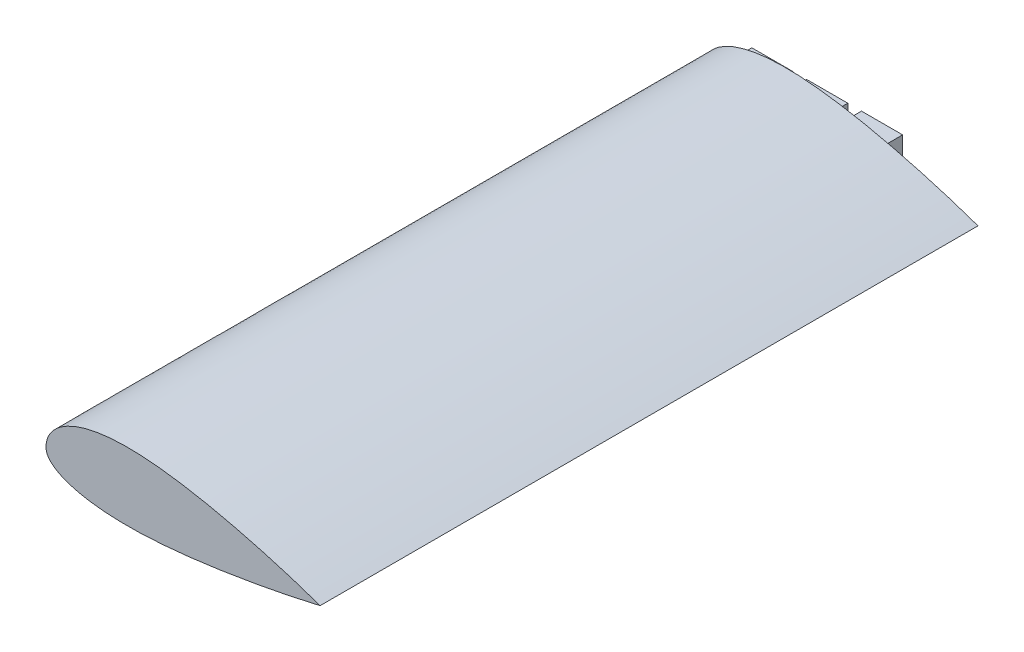
ISO-10303-21;
HEADER;
FILE_DESCRIPTION(('STEP AP214'),'2;1');
FILE_NAME('part.step','',(''),(''),'','','');
FILE_SCHEMA(('AUTOMOTIVE_DESIGN { 1 0 10303 214 1 1 1 1 }'));
ENDSEC;
DATA;
#1=APPLICATION_CONTEXT('core data for automotive mechanical design processes');
#2=APPLICATION_PROTOCOL_DEFINITION('international standard','automotive_design',2000,#1);
#3=PRODUCT_CONTEXT('',#1,'mechanical');
#4=PRODUCT('Part','Part','',(#3));
#5=PRODUCT_RELATED_PRODUCT_CATEGORY('part','',(#4));
#6=PRODUCT_DEFINITION_FORMATION('','',#4);
#7=PRODUCT_DEFINITION_CONTEXT('part definition',#1,'design');
#8=PRODUCT_DEFINITION('design','',#6,#7);
#9=PRODUCT_DEFINITION_SHAPE('','',#8);
#10=(LENGTH_UNIT() NAMED_UNIT(*) SI_UNIT(.MILLI.,.METRE.));
#11=(NAMED_UNIT(*) PLANE_ANGLE_UNIT() SI_UNIT($,.RADIAN.));
#12=(NAMED_UNIT(*) SI_UNIT($,.STERADIAN.) SOLID_ANGLE_UNIT());
#13=UNCERTAINTY_MEASURE_WITH_UNIT(LENGTH_MEASURE(1.E-05),#10,'distance_accuracy_value','');
#14=(GEOMETRIC_REPRESENTATION_CONTEXT(3) GLOBAL_UNCERTAINTY_ASSIGNED_CONTEXT((#13)) GLOBAL_UNIT_ASSIGNED_CONTEXT((#10,
#11,#12)) REPRESENTATION_CONTEXT('',''));
#15=CARTESIAN_POINT('',(0.,0.,0.));
#16=DIRECTION('',(0.,0.,1.));
#17=DIRECTION('',(1.,0.,0.));
#18=AXIS2_PLACEMENT_3D('',#15,#16,#17);
#19=CARTESIAN_POINT('',(0.,0.,125.));
#20=CARTESIAN_POINT('',(0.000283694063333354,-0.169267254453406,125.));
#21=CARTESIAN_POINT('',(0.0159767940668219,-0.461371136285982,125.));
#22=CARTESIAN_POINT('',(0.077487024771383,-0.88514163989418,125.));
#23=CARTESIAN_POINT('',(0.233270025784223,-1.43564988481677,125.));
#24=CARTESIAN_POINT('',(0.451244669499748,-1.96091850518129,125.));
#25=CARTESIAN_POINT('',(0.763020390680075,-2.51568290885771,125.));
#26=CARTESIAN_POINT('',(1.19681968312183,-3.11184641205846,125.));
#27=CARTESIAN_POINT('',(1.80094642938857,-3.76671123900316,125.));
#28=CARTESIAN_POINT('',(2.64586284499477,-4.49541317249192,125.));
#29=CARTESIAN_POINT('',(3.84500980685611,-5.31516311770543,125.));
#30=CARTESIAN_POINT('',(5.52019286873323,-6.21058744479242,125.));
#31=CARTESIAN_POINT('',(7.89048732661226,-7.18071487461165,125.));
#32=CARTESIAN_POINT('',(10.9470620487076,-8.09627648056987,125.));
#33=CARTESIAN_POINT('',(15.4296046071689,-9.03964097855671,125.));
#34=CARTESIAN_POINT('',(21.2079673661791,-9.73001113298884,125.));
#35=CARTESIAN_POINT('',(27.9775359918798,-10.0274621502473,125.));
#36=CARTESIAN_POINT('',(35.6486028756696,-9.88912829906542,125.));
#37=CARTESIAN_POINT('',(42.3468643354063,-9.46570665665719,125.));
#38=CARTESIAN_POINT('',(48.0748271030601,-8.93985542983438,125.));
#39=CARTESIAN_POINT('',(53.7914771788293,-8.30609592856954,125.));
#40=CARTESIAN_POINT('',(59.49683061861,-7.57655022215473,125.));
#41=CARTESIAN_POINT('',(65.1884999888793,-6.74605157792133,125.));
#42=CARTESIAN_POINT('',(70.8666683199729,-5.83024062202182,125.));
#43=CARTESIAN_POINT('',(75.5898698632803,-5.01418177414959,125.));
#44=CARTESIAN_POINT('',(79.3624472128974,-4.33071773017941,125.));
#45=CARTESIAN_POINT('',(82.659602016109,-3.70583024829414,125.));
#46=CARTESIAN_POINT('',(85.4801069964598,-3.15149152411546,125.));
#47=CARTESIAN_POINT('',(87.596226542746,-2.72328053338139,125.));
#48=CARTESIAN_POINT('',(89.0004891130609,-2.43412388465058,125.));
#49=CARTESIAN_POINT('',(90.1810594846734,-2.18718549633528,125.));
#50=CARTESIAN_POINT('',(91.1040292308201,-1.99256241658825,125.));
#51=CARTESIAN_POINT('',(92.3050998158475,-1.73539032834916,125.));
#52=CARTESIAN_POINT('',(93.6554040217478,-1.44386068745151,125.));
#53=CARTESIAN_POINT('',(95.3898106893253,-1.05964307714984,125.));
#54=CARTESIAN_POINT('',(97.1026637555893,-0.674849293285817,125.));
#55=CARTESIAN_POINT('',(98.7144505723077,-0.301843412019252,125.));
#56=CARTESIAN_POINT('',(99.5756271529091,-0.100232022205954,125.));
#57=CARTESIAN_POINT('',(100.000220499757,4.27538111521814E-10,125.));
#58=B_SPLINE_CURVE_WITH_KNOTS('',4,(#19,#20,#21,#22,#23,#24,#25,#26,#27,#28,#29,#30,#31,#32,#33,
#34,#35,#36,#37,#38,#39,#40,#41,#42,#43,#44,#45,#46,#47,#48,#49,#50,#51,#52,#53,#54,#55,#56,
#57),.UNSPECIFIED.,.F.,.F.,(5,1,1,1,1,1,1,1,1,1,1,1,1,1,1,1,1,1,1,1,1,1,1,1,1,1,1,1,1,1,1,1,1,1,
1,5),(0.,0.00588715154905901,0.0101933589214028,0.0148668514587516,0.0198894261791057,
0.0256553974171273,0.0323146974482692,0.0404975269047319,0.0508649023094947,0.064448178964699,
0.0828230857867248,0.10655566445833,0.139953894502326,0.175459216314004,0.242255955916231,
0.309052715876462,0.375849476599394,0.442646237076871,0.476044620001209,0.509443002925548,
0.57623976423232,0.643036526709283,0.676434909065151,0.709833291421019,0.743231670810562,
0.776630050200105,0.793329241625757,0.81002843305141,0.818378028764236,0.826727624477062,
0.835077220189888,0.843426815902715,0.86012600697153,0.876825198040345,0.893524389109161,
0.910223580157939),.UNSPECIFIED.);
#59=DIRECTION('',(0.,0.,-1.));
#60=VECTOR('',#59,1.);
#61=SURFACE_OF_LINEAR_EXTRUSION('',#58,#60);
#62=CARTESIAN_POINT('',(0.,0.,-115.));
#63=CARTESIAN_POINT('',(0.000283694063333354,-0.169267254453406,-115.));
#64=CARTESIAN_POINT('',(0.0159767940668219,-0.461371136285982,-115.));
#65=CARTESIAN_POINT('',(0.077487024771383,-0.88514163989418,-115.));
#66=CARTESIAN_POINT('',(0.233270025784223,-1.43564988481677,-115.));
#67=CARTESIAN_POINT('',(0.451244669499748,-1.96091850518129,-115.));
#68=CARTESIAN_POINT('',(0.763020390680075,-2.51568290885771,-115.));
#69=CARTESIAN_POINT('',(1.19681968312183,-3.11184641205846,-115.));
#70=CARTESIAN_POINT('',(1.80094642938857,-3.76671123900316,-115.));
#71=CARTESIAN_POINT('',(2.64586284499477,-4.49541317249192,-115.));
#72=CARTESIAN_POINT('',(3.84500980685611,-5.31516311770543,-115.));
#73=CARTESIAN_POINT('',(5.52019286873323,-6.21058744479242,-115.));
#74=CARTESIAN_POINT('',(7.89048732661226,-7.18071487461165,-115.));
#75=CARTESIAN_POINT('',(10.9470620487076,-8.09627648056987,-115.));
#76=CARTESIAN_POINT('',(15.4296046071689,-9.03964097855671,-115.));
#77=CARTESIAN_POINT('',(21.2079673661791,-9.73001113298884,-115.));
#78=CARTESIAN_POINT('',(27.9775359918798,-10.0274621502473,-115.));
#79=CARTESIAN_POINT('',(35.6486028756696,-9.88912829906542,-115.));
#80=CARTESIAN_POINT('',(42.3468643354063,-9.46570665665719,-115.));
#81=CARTESIAN_POINT('',(48.0748271030601,-8.93985542983438,-115.));
#82=CARTESIAN_POINT('',(53.7914771788293,-8.30609592856954,-115.));
#83=CARTESIAN_POINT('',(59.49683061861,-7.57655022215473,-115.));
#84=CARTESIAN_POINT('',(65.1884999888793,-6.74605157792133,-115.));
#85=CARTESIAN_POINT('',(70.8666683199729,-5.83024062202182,-115.));
#86=CARTESIAN_POINT('',(75.5898698632803,-5.01418177414959,-115.));
#87=CARTESIAN_POINT('',(79.3624472128974,-4.33071773017941,-115.));
#88=CARTESIAN_POINT('',(82.659602016109,-3.70583024829414,-115.));
#89=CARTESIAN_POINT('',(85.4801069964598,-3.15149152411546,-115.));
#90=CARTESIAN_POINT('',(87.596226542746,-2.72328053338139,-115.));
#91=CARTESIAN_POINT('',(89.0004891130609,-2.43412388465058,-115.));
#92=CARTESIAN_POINT('',(90.1810594846734,-2.18718549633528,-115.));
#93=CARTESIAN_POINT('',(91.1040292308201,-1.99256241658825,-115.));
#94=CARTESIAN_POINT('',(92.3050998158475,-1.73539032834916,-115.));
#95=CARTESIAN_POINT('',(93.6554040217478,-1.44386068745151,-115.));
#96=CARTESIAN_POINT('',(95.3898106893253,-1.05964307714984,-115.));
#97=CARTESIAN_POINT('',(97.1026637555893,-0.674849293285817,-115.));
#98=CARTESIAN_POINT('',(98.7144505723077,-0.301843412019252,-115.));
#99=CARTESIAN_POINT('',(99.5756271529091,-0.100232022205954,-115.));
#100=CARTESIAN_POINT('',(100.000220499757,4.27538111521814E-10,-115.));
#101=B_SPLINE_CURVE_WITH_KNOTS('',4,(#62,#63,#64,#65,#66,#67,#68,#69,#70,#71,#72,#73,#74,#75,
#76,#77,#78,#79,#80,#81,#82,#83,#84,#85,#86,#87,#88,#89,#90,#91,#92,#93,#94,#95,#96,#97,#98,#99,
#100),.UNSPECIFIED.,.F.,.F.,(5,1,1,1,1,1,1,1,1,1,1,1,1,1,1,1,1,1,1,1,1,1,1,1,1,1,1,1,1,1,1,1,1,
1,1,5),(0.,0.00588715154905901,0.0101933589214028,0.0148668514587516,0.0198894261791057,
0.0256553974171273,0.0323146974482692,0.0404975269047319,0.0508649023094947,0.064448178964699,
0.0828230857867248,0.10655566445833,0.139953894502326,0.175459216314004,0.242255955916231,
0.309052715876462,0.375849476599394,0.442646237076871,0.476044620001209,0.509443002925548,
0.57623976423232,0.643036526709283,0.676434909065151,0.709833291421019,0.743231670810562,
0.776630050200105,0.793329241625757,0.81002843305141,0.818378028764236,0.826727624477062,
0.835077220189888,0.843426815902715,0.86012600697153,0.876825198040345,0.893524389109161,
0.910223580157939),.UNSPECIFIED.);
#102=CARTESIAN_POINT('',(100.000220497727,7.74826209021324E-11,-115.));
#103=VERTEX_POINT('',#102);
#104=CARTESIAN_POINT('',(0.,0.,-115.));
#105=VERTEX_POINT('',#104);
#106=EDGE_CURVE('E52',#103,#105,#101,.F.);
#107=ORIENTED_EDGE('',*,*,#106,.F.);
#108=DIRECTION('',(0.,0.,-1.));
#109=VECTOR('',#108,1.);
#110=CARTESIAN_POINT('',(100.000220497727,7.74826209021324E-11,125.));
#111=LINE('',#110,#109);
#112=CARTESIAN_POINT('',(100.000220497727,7.74826209021324E-11,125.));
#113=VERTEX_POINT('',#112);
#114=EDGE_CURVE('E47',#113,#103,#111,.T.);
#115=ORIENTED_EDGE('',*,*,#114,.F.);
#116=CARTESIAN_POINT('',(0.,0.,125.));
#117=VERTEX_POINT('',#116);
#118=EDGE_CURVE('E322',#117,#113,#58,.T.);
#119=ORIENTED_EDGE('',*,*,#118,.F.);
#120=DIRECTION('',(0.,0.,-1.));
#121=VECTOR('',#120,1.);
#122=CARTESIAN_POINT('',(0.,0.,125.));
#123=LINE('',#122,#121);
#124=EDGE_CURVE('E321',#117,#105,#123,.T.);
#125=ORIENTED_EDGE('',*,*,#124,.T.);
#126=EDGE_LOOP('',(#107,#115,#119,#125));
#127=FACE_BOUND('',#126,.T.);
#128=ADVANCED_FACE('F37',(#127),#61,.F.);
#129=CARTESIAN_POINT('',(100.000220497727,7.74826209021324E-11,125.));
#130=CARTESIAN_POINT('',(99.5866642694272,0.146529650141644,125.));
#131=CARTESIAN_POINT('',(98.775140124959,0.431667146722528,125.));
#132=CARTESIAN_POINT('',(97.1383013596421,1.0009448593004,125.));
#133=CARTESIAN_POINT('',(95.5201536219595,1.54629412604241,125.));
#134=CARTESIAN_POINT('',(93.5710424127269,2.19555173767905,125.));
#135=CARTESIAN_POINT('',(91.8060339087632,2.76657559109394,125.));
#136=CARTESIAN_POINT('',(89.9289485013176,3.36462288486606,125.));
#137=CARTESIAN_POINT('',(88.1107461076308,3.92939510407735,125.));
#138=CARTESIAN_POINT('',(86.2537376155131,4.49573782099316,125.));
#139=CARTESIAN_POINT('',(84.4127461033344,5.04441519253935,125.));
#140=CARTESIAN_POINT('',(82.0959555474998,5.72096027189785,125.));
#141=CARTESIAN_POINT('',(79.3157485343101,6.50932427591325,125.));
#142=CARTESIAN_POINT('',(76.0598011549019,7.39936223716674,125.));
#143=CARTESIAN_POINT('',(72.3294262722737,8.37255611177963,125.));
#144=CARTESIAN_POINT('',(68.5864601940137,9.3014640978493,125.));
#145=CARTESIAN_POINT('',(64.832774322819,10.1829703393817,125.));
#146=CARTESIAN_POINT('',(61.0671483874732,11.0139213357228,125.));
#147=CARTESIAN_POINT('',(56.3455787547304,11.9833516977112,125.));
#148=CARTESIAN_POINT('',(51.6037180711226,12.8505137555291,125.));
#149=CARTESIAN_POINT('',(46.841005730155,13.5967745663557,125.));
#150=CARTESIAN_POINT('',(41.1010612259678,14.3137531123523,125.));
#151=CARTESIAN_POINT('',(35.3379801907108,14.8247996680982,125.));
#152=CARTESIAN_POINT('',(29.2356829585059,15.0274458231264,125.));
#153=CARTESIAN_POINT('',(23.1343223198202,14.7365696045775,125.));
#154=CARTESIAN_POINT('',(18.0404606093291,14.0363288531348,125.));
#155=CARTESIAN_POINT('',(14.1476534921483,13.1525343183008,125.));
#156=CARTESIAN_POINT('',(10.9569632810599,12.1146314327558,125.));
#157=CARTESIAN_POINT('',(8.27408643464805,10.9291862288056,125.));
#158=CARTESIAN_POINT('',(6.15403284092467,9.71494891854934,125.));
#159=CARTESIAN_POINT('',(4.49593380655627,8.51062575858427,125.));
#160=CARTESIAN_POINT('',(3.20033079537978,7.32999492228908,125.));
#161=CARTESIAN_POINT('',(2.19231516242372,6.17730577602011,125.));
#162=CARTESIAN_POINT('',(1.43145787309525,5.07560620825464,125.));
#163=CARTESIAN_POINT('',(0.854897816381184,3.99067399021966,125.));
#164=CARTESIAN_POINT('',(0.437026819139792,2.91811654456705,125.));
#165=CARTESIAN_POINT('',(0.143851329684659,1.7967459021599,125.));
#166=CARTESIAN_POINT('',(0.0295498653493342,0.927472015318214,125.));
#167=CARTESIAN_POINT('',(0.000850995267059923,0.329659199222127,125.));
#168=CARTESIAN_POINT('',(0.,0.,125.));
#169=B_SPLINE_CURVE_WITH_KNOTS('',4,(#129,#130,#131,#132,#133,#134,#135,#136,#137,#138,#139,
#140,#141,#142,#143,#144,#145,#146,#147,#148,#149,#150,#151,#152,#153,#154,#155,#156,#157,#158,
#159,#160,#161,#162,#163,#164,#165,#166,#167,#168),.UNSPECIFIED.,.F.,.F.,(5,1,1,1,1,1,1,1,1,1,1,
1,1,1,1,1,1,1,1,1,1,1,1,1,1,1,1,1,1,1,1,1,1,1,1,1,5),(0.,0.0161684388922648,0.0323395717476721,
0.0485107046030794,0.0646818374584867,0.0808529669347967,0.0970240964111069,0.113195225887417,
0.129366355363727,0.145537483468899,0.161708611574071,0.194050867784415,0.226393127402294,
0.258735387020172,0.291077649856262,0.323419912692352,0.355762172547114,0.388104432401876,
0.452788946311646,0.485131206531116,0.517473466750585,0.582157982254849,0.646842489324408,
0.689784621390112,0.722126932647819,0.754469038652625,0.780606905242231,0.802168575944157,
0.82036335835708,0.836287728406092,0.849224342016667,0.86085384754246,0.87163201202684,
0.881108097545938,0.890352169571197,0.899387833639312,0.910433902416971),.UNSPECIFIED.);
#170=DIRECTION('',(0.,0.,-1.));
#171=VECTOR('',#170,1.);
#172=SURFACE_OF_LINEAR_EXTRUSION('',#169,#171);
#173=CARTESIAN_POINT('',(100.000220497727,7.74826209021324E-11,-115.));
#174=CARTESIAN_POINT('',(99.5866642694272,0.146529650141644,-115.));
#175=CARTESIAN_POINT('',(98.775140124959,0.431667146722528,-115.));
#176=CARTESIAN_POINT('',(97.1383013596421,1.0009448593004,-115.));
#177=CARTESIAN_POINT('',(95.5201536219595,1.54629412604241,-115.));
#178=CARTESIAN_POINT('',(93.5710424127269,2.19555173767905,-115.));
#179=CARTESIAN_POINT('',(91.8060339087632,2.76657559109394,-115.));
#180=CARTESIAN_POINT('',(89.9289485013176,3.36462288486606,-115.));
#181=CARTESIAN_POINT('',(88.1107461076308,3.92939510407735,-115.));
#182=CARTESIAN_POINT('',(86.2537376155131,4.49573782099316,-115.));
#183=CARTESIAN_POINT('',(84.4127461033344,5.04441519253935,-115.));
#184=CARTESIAN_POINT('',(82.0959555474998,5.72096027189785,-115.));
#185=CARTESIAN_POINT('',(79.3157485343101,6.50932427591325,-115.));
#186=CARTESIAN_POINT('',(76.0598011549019,7.39936223716674,-115.));
#187=CARTESIAN_POINT('',(72.3294262722737,8.37255611177963,-115.));
#188=CARTESIAN_POINT('',(68.5864601940137,9.3014640978493,-115.));
#189=CARTESIAN_POINT('',(64.832774322819,10.1829703393817,-115.));
#190=CARTESIAN_POINT('',(61.0671483874732,11.0139213357228,-115.));
#191=CARTESIAN_POINT('',(56.3455787547304,11.9833516977112,-115.));
#192=CARTESIAN_POINT('',(51.6037180711226,12.8505137555291,-115.));
#193=CARTESIAN_POINT('',(46.841005730155,13.5967745663557,-115.));
#194=CARTESIAN_POINT('',(41.1010612259678,14.3137531123523,-115.));
#195=CARTESIAN_POINT('',(35.3379801907108,14.8247996680982,-115.));
#196=CARTESIAN_POINT('',(29.2356829585059,15.0274458231264,-115.));
#197=CARTESIAN_POINT('',(23.1343223198202,14.7365696045775,-115.));
#198=CARTESIAN_POINT('',(18.0404606093291,14.0363288531348,-115.));
#199=CARTESIAN_POINT('',(14.1476534921483,13.1525343183008,-115.));
#200=CARTESIAN_POINT('',(10.9569632810599,12.1146314327558,-115.));
#201=CARTESIAN_POINT('',(8.27408643464805,10.9291862288056,-115.));
#202=CARTESIAN_POINT('',(6.15403284092467,9.71494891854934,-115.));
#203=CARTESIAN_POINT('',(4.49593380655627,8.51062575858427,-115.));
#204=CARTESIAN_POINT('',(3.20033079537978,7.32999492228908,-115.));
#205=CARTESIAN_POINT('',(2.19231516242372,6.17730577602011,-115.));
#206=CARTESIAN_POINT('',(1.43145787309525,5.07560620825464,-115.));
#207=CARTESIAN_POINT('',(0.854897816381184,3.99067399021966,-115.));
#208=CARTESIAN_POINT('',(0.437026819139792,2.91811654456705,-115.));
#209=CARTESIAN_POINT('',(0.143851329684659,1.7967459021599,-115.));
#210=CARTESIAN_POINT('',(0.0295498653493342,0.927472015318214,-115.));
#211=CARTESIAN_POINT('',(0.000850995267059923,0.329659199222127,-115.));
#212=CARTESIAN_POINT('',(0.,0.,-115.));
#213=B_SPLINE_CURVE_WITH_KNOTS('',4,(#173,#174,#175,#176,#177,#178,#179,#180,#181,#182,#183,
#184,#185,#186,#187,#188,#189,#190,#191,#192,#193,#194,#195,#196,#197,#198,#199,#200,#201,#202,
#203,#204,#205,#206,#207,#208,#209,#210,#211,#212),.UNSPECIFIED.,.F.,.F.,(5,1,1,1,1,1,1,1,1,1,1,
1,1,1,1,1,1,1,1,1,1,1,1,1,1,1,1,1,1,1,1,1,1,1,1,1,5),(0.,0.0161684388922648,0.0323395717476721,
0.0485107046030794,0.0646818374584867,0.0808529669347967,0.0970240964111069,0.113195225887417,
0.129366355363727,0.145537483468899,0.161708611574071,0.194050867784415,0.226393127402294,
0.258735387020172,0.291077649856262,0.323419912692352,0.355762172547114,0.388104432401876,
0.452788946311646,0.485131206531116,0.517473466750585,0.582157982254849,0.646842489324408,
0.689784621390112,0.722126932647819,0.754469038652625,0.780606905242231,0.802168575944157,
0.82036335835708,0.836287728406092,0.849224342016667,0.86085384754246,0.87163201202684,
0.881108097545938,0.890352169571197,0.899387833639312,0.910433902416971),.UNSPECIFIED.);
#214=EDGE_CURVE('E12',#105,#103,#213,.F.);
#215=ORIENTED_EDGE('',*,*,#214,.F.);
#216=ORIENTED_EDGE('',*,*,#124,.F.);
#217=EDGE_CURVE('E316',#113,#117,#169,.T.);
#218=ORIENTED_EDGE('',*,*,#217,.F.);
#219=ORIENTED_EDGE('',*,*,#114,.T.);
#220=EDGE_LOOP('',(#215,#216,#218,#219));
#221=FACE_BOUND('',#220,.T.);
#222=ADVANCED_FACE('F306',(#221),#172,.F.);
#223=CARTESIAN_POINT('',(48.5429190731923,-8.87264976056938,125.));
#224=DIRECTION('',(0.,0.,-1.));
#225=DIRECTION('',(-1.,0.,0.));
#226=AXIS2_PLACEMENT_3D('',#223,#224,#225);
#227=PLANE('',#226);
#228=ORIENTED_EDGE('',*,*,#118,.T.);
#229=ORIENTED_EDGE('',*,*,#217,.T.);
#230=EDGE_LOOP('',(#228,#229));
#231=FACE_BOUND('',#230,.T.);
#232=ADVANCED_FACE('F303',(#231),#227,.F.);
#233=CARTESIAN_POINT('',(50.0001102498784,2.49999183643953,-115.));
#234=DIRECTION('',(0.,0.,-1.));
#235=DIRECTION('',(-1.,0.,0.));
#236=AXIS2_PLACEMENT_3D('',#233,#234,#235);
#237=PLANE('',#236);
#238=DIRECTION('',(1.,0.,0.));
#239=VECTOR('',#238,1.);
#240=CARTESIAN_POINT('',(22.5,5.,-115.));
#241=LINE('',#240,#239);
#242=CARTESIAN_POINT('',(7.50000000000001,5.,-115.));
#243=VERTEX_POINT('',#242);
#244=CARTESIAN_POINT('',(22.5,5.,-115.));
#245=VERTEX_POINT('',#244);
#246=EDGE_CURVE('E239',#243,#245,#241,.T.);
#247=ORIENTED_EDGE('',*,*,#246,.F.);
#248=DIRECTION('',(0.,1.,0.));
#249=VECTOR('',#248,1.);
#250=CARTESIAN_POINT('',(7.50000000000001,-5.,-115.));
#251=LINE('',#250,#249);
#252=CARTESIAN_POINT('',(7.50000000000001,-5.,-115.));
#253=VERTEX_POINT('',#252);
#254=EDGE_CURVE('E236',#253,#243,#251,.T.);
#255=ORIENTED_EDGE('',*,*,#254,.F.);
#256=DIRECTION('',(-1.,0.,0.));
#257=VECTOR('',#256,1.);
#258=CARTESIAN_POINT('',(22.5,-4.99999999999999,-115.));
#259=LINE('',#258,#257);
#260=CARTESIAN_POINT('',(22.5,-4.99999999999999,-115.));
#261=VERTEX_POINT('',#260);
#262=EDGE_CURVE('E232',#261,#253,#259,.T.);
#263=ORIENTED_EDGE('',*,*,#262,.F.);
#264=DIRECTION('',(0.,-1.,0.));
#265=VECTOR('',#264,1.);
#266=CARTESIAN_POINT('',(22.5,-4.99999999999999,-115.));
#267=LINE('',#266,#265);
#268=EDGE_CURVE('E229',#245,#261,#267,.T.);
#269=ORIENTED_EDGE('',*,*,#268,.F.);
#270=EDGE_LOOP('',(#247,#255,#263,#269));
#271=FACE_BOUND('',#270,.T.);
#272=DIRECTION('',(-1.,0.,0.));
#273=VECTOR('',#272,1.);
#274=CARTESIAN_POINT('',(47.5,-5.,-115.));
#275=LINE('',#274,#273);
#276=CARTESIAN_POINT('',(62.5,-5.,-115.));
#277=VERTEX_POINT('',#276);
#278=CARTESIAN_POINT('',(47.5,-5.,-115.));
#279=VERTEX_POINT('',#278);
#280=EDGE_CURVE('E206',#277,#279,#275,.T.);
#281=ORIENTED_EDGE('',*,*,#280,.F.);
#282=DIRECTION('',(0.,-1.,0.));
#283=VECTOR('',#282,1.);
#284=CARTESIAN_POINT('',(62.5,5.,-115.));
#285=LINE('',#284,#283);
#286=CARTESIAN_POINT('',(62.5,5.,-115.));
#287=VERTEX_POINT('',#286);
#288=EDGE_CURVE('E203',#287,#277,#285,.T.);
#289=ORIENTED_EDGE('',*,*,#288,.F.);
#290=DIRECTION('',(1.,0.,0.));
#291=VECTOR('',#290,1.);
#292=CARTESIAN_POINT('',(47.5,5.,-115.));
#293=LINE('',#292,#291);
#294=CARTESIAN_POINT('',(47.5,5.,-115.));
#295=VERTEX_POINT('',#294);
#296=EDGE_CURVE('E199',#295,#287,#293,.T.);
#297=ORIENTED_EDGE('',*,*,#296,.F.);
#298=DIRECTION('',(0.,1.,0.));
#299=VECTOR('',#298,1.);
#300=CARTESIAN_POINT('',(47.5,5.,-115.));
#301=LINE('',#300,#299);
#302=EDGE_CURVE('E196',#279,#295,#301,.T.);
#303=ORIENTED_EDGE('',*,*,#302,.F.);
#304=EDGE_LOOP('',(#281,#289,#297,#303));
#305=FACE_BOUND('',#304,.T.);
#306=DIRECTION('',(-1.,0.,0.));
#307=VECTOR('',#306,1.);
#308=CARTESIAN_POINT('',(27.5,-5.,-115.));
#309=LINE('',#308,#307);
#310=CARTESIAN_POINT('',(42.5,-5.,-115.));
#311=VERTEX_POINT('',#310);
#312=CARTESIAN_POINT('',(27.5,-5.,-115.));
#313=VERTEX_POINT('',#312);
#314=EDGE_CURVE('E164',#311,#313,#309,.T.);
#315=ORIENTED_EDGE('',*,*,#314,.F.);
#316=DIRECTION('',(0.,-1.,0.));
#317=VECTOR('',#316,1.);
#318=CARTESIAN_POINT('',(42.5,5.,-115.));
#319=LINE('',#318,#317);
#320=CARTESIAN_POINT('',(42.5,5.,-115.));
#321=VERTEX_POINT('',#320);
#322=EDGE_CURVE('E173',#321,#311,#319,.T.);
#323=ORIENTED_EDGE('',*,*,#322,.F.);
#324=DIRECTION('',(1.,0.,0.));
#325=VECTOR('',#324,1.);
#326=CARTESIAN_POINT('',(27.5,5.,-115.));
#327=LINE('',#326,#325);
#328=CARTESIAN_POINT('',(27.5,5.,-115.));
#329=VERTEX_POINT('',#328);
#330=EDGE_CURVE('E156',#329,#321,#327,.T.);
#331=ORIENTED_EDGE('',*,*,#330,.F.);
#332=DIRECTION('',(0.,1.,0.));
#333=VECTOR('',#332,1.);
#334=CARTESIAN_POINT('',(27.5,5.,-115.));
#335=LINE('',#334,#333);
#336=EDGE_CURVE('E170',#313,#329,#335,.T.);
#337=ORIENTED_EDGE('',*,*,#336,.F.);
#338=EDGE_LOOP('',(#315,#323,#331,#337));
#339=FACE_BOUND('',#338,.T.);
#340=ORIENTED_EDGE('',*,*,#106,.T.);
#341=ORIENTED_EDGE('',*,*,#214,.T.);
#342=EDGE_LOOP('',(#340,#341));
#343=FACE_BOUND('',#342,.T.);
#344=ADVANCED_FACE('F169',(#271,#305,#339,#343),#237,.T.);
#345=CARTESIAN_POINT('',(22.5,-4.99999999999999,-115.));
#346=DIRECTION('',(1.,0.,0.));
#347=DIRECTION('',(0.,0.,-1.));
#348=AXIS2_PLACEMENT_3D('',#345,#346,#347);
#349=PLANE('',#348);
#350=DIRECTION('',(0.,-1.,0.));
#351=VECTOR('',#350,1.);
#352=CARTESIAN_POINT('',(22.5,-4.99999999999999,-125.));
#353=LINE('',#352,#351);
#354=CARTESIAN_POINT('',(22.5,5.,-125.));
#355=VERTEX_POINT('',#354);
#356=CARTESIAN_POINT('',(22.5,-4.99999999999999,-125.));
#357=VERTEX_POINT('',#356);
#358=EDGE_CURVE('E222',#355,#357,#353,.T.);
#359=ORIENTED_EDGE('',*,*,#358,.F.);
#360=DIRECTION('',(0.,0.,-1.));
#361=VECTOR('',#360,1.);
#362=CARTESIAN_POINT('',(22.5,5.,-115.));
#363=LINE('',#362,#361);
#364=EDGE_CURVE('E251',#245,#355,#363,.T.);
#365=ORIENTED_EDGE('',*,*,#364,.F.);
#366=ORIENTED_EDGE('',*,*,#268,.T.);
#367=DIRECTION('',(0.,0.,-1.));
#368=VECTOR('',#367,1.);
#369=CARTESIAN_POINT('',(22.5,-4.99999999999999,-115.));
#370=LINE('',#369,#368);
#371=EDGE_CURVE('E242',#261,#357,#370,.T.);
#372=ORIENTED_EDGE('',*,*,#371,.T.);
#373=EDGE_LOOP('',(#359,#365,#366,#372));
#374=FACE_BOUND('',#373,.T.);
#375=ADVANCED_FACE('F359',(#374),#349,.T.);
#376=CARTESIAN_POINT('',(22.5,5.,-115.));
#377=DIRECTION('',(0.,1.,0.));
#378=DIRECTION('',(-1.,0.,0.));
#379=AXIS2_PLACEMENT_3D('',#376,#377,#378);
#380=PLANE('',#379);
#381=DIRECTION('',(1.,0.,0.));
#382=VECTOR('',#381,1.);
#383=CARTESIAN_POINT('',(22.5,5.,-125.));
#384=LINE('',#383,#382);
#385=CARTESIAN_POINT('',(7.50000000000001,5.,-125.));
#386=VERTEX_POINT('',#385);
#387=EDGE_CURVE('E233',#386,#355,#384,.T.);
#388=ORIENTED_EDGE('',*,*,#387,.F.);
#389=DIRECTION('',(0.,0.,-1.));
#390=VECTOR('',#389,1.);
#391=CARTESIAN_POINT('',(7.50000000000001,5.,-115.));
#392=LINE('',#391,#390);
#393=EDGE_CURVE('E253',#243,#386,#392,.T.);
#394=ORIENTED_EDGE('',*,*,#393,.F.);
#395=ORIENTED_EDGE('',*,*,#246,.T.);
#396=ORIENTED_EDGE('',*,*,#364,.T.);
#397=EDGE_LOOP('',(#388,#394,#395,#396));
#398=FACE_BOUND('',#397,.T.);
#399=ADVANCED_FACE('F363',(#398),#380,.T.);
#400=CARTESIAN_POINT('',(7.50000000000001,-5.,-115.));
#401=DIRECTION('',(-1.,0.,0.));
#402=DIRECTION('',(0.,0.,1.));
#403=AXIS2_PLACEMENT_3D('',#400,#401,#402);
#404=PLANE('',#403);
#405=DIRECTION('',(0.,1.,0.));
#406=VECTOR('',#405,1.);
#407=CARTESIAN_POINT('',(7.50000000000001,-5.,-125.));
#408=LINE('',#407,#406);
#409=CARTESIAN_POINT('',(7.50000000000001,-5.,-125.));
#410=VERTEX_POINT('',#409);
#411=EDGE_CURVE('E60',#410,#386,#408,.T.);
#412=ORIENTED_EDGE('',*,*,#411,.F.);
#413=DIRECTION('',(0.,0.,-1.));
#414=VECTOR('',#413,1.);
#415=CARTESIAN_POINT('',(7.50000000000001,-5.,-115.));
#416=LINE('',#415,#414);
#417=EDGE_CURVE('E255',#253,#410,#416,.T.);
#418=ORIENTED_EDGE('',*,*,#417,.F.);
#419=ORIENTED_EDGE('',*,*,#254,.T.);
#420=ORIENTED_EDGE('',*,*,#393,.T.);
#421=EDGE_LOOP('',(#412,#418,#419,#420));
#422=FACE_BOUND('',#421,.T.);
#423=ADVANCED_FACE('F369',(#422),#404,.T.);
#424=CARTESIAN_POINT('',(22.5,-4.99999999999999,-115.));
#425=DIRECTION('',(0.,-1.,0.));
#426=DIRECTION('',(1.,0.,0.));
#427=AXIS2_PLACEMENT_3D('',#424,#425,#426);
#428=PLANE('',#427);
#429=DIRECTION('',(-1.,0.,0.));
#430=VECTOR('',#429,1.);
#431=CARTESIAN_POINT('',(22.5,-4.99999999999999,-125.));
#432=LINE('',#431,#430);
#433=EDGE_CURVE('E245',#357,#410,#432,.T.);
#434=ORIENTED_EDGE('',*,*,#433,.F.);
#435=ORIENTED_EDGE('',*,*,#371,.F.);
#436=ORIENTED_EDGE('',*,*,#262,.T.);
#437=ORIENTED_EDGE('',*,*,#417,.T.);
#438=EDGE_LOOP('',(#434,#435,#436,#437));
#439=FACE_BOUND('',#438,.T.);
#440=ADVANCED_FACE('F365',(#439),#428,.T.);
#441=CARTESIAN_POINT('',(47.5,5.,-115.));
#442=DIRECTION('',(-1.,0.,0.));
#443=DIRECTION('',(0.,0.,1.));
#444=AXIS2_PLACEMENT_3D('',#441,#442,#443);
#445=PLANE('',#444);
#446=DIRECTION('',(0.,1.,0.));
#447=VECTOR('',#446,1.);
#448=CARTESIAN_POINT('',(47.5,5.,-125.));
#449=LINE('',#448,#447);
#450=CARTESIAN_POINT('',(47.5,-5.,-125.));
#451=VERTEX_POINT('',#450);
#452=CARTESIAN_POINT('',(47.5,5.,-125.));
#453=VERTEX_POINT('',#452);
#454=EDGE_CURVE('E192',#451,#453,#449,.T.);
#455=ORIENTED_EDGE('',*,*,#454,.F.);
#456=DIRECTION('',(0.,0.,-1.));
#457=VECTOR('',#456,1.);
#458=CARTESIAN_POINT('',(47.5,-5.,-115.));
#459=LINE('',#458,#457);
#460=EDGE_CURVE('E220',#279,#451,#459,.T.);
#461=ORIENTED_EDGE('',*,*,#460,.F.);
#462=ORIENTED_EDGE('',*,*,#302,.T.);
#463=DIRECTION('',(0.,0.,-1.));
#464=VECTOR('',#463,1.);
#465=CARTESIAN_POINT('',(47.5,5.,-115.));
#466=LINE('',#465,#464);
#467=EDGE_CURVE('E209',#295,#453,#466,.T.);
#468=ORIENTED_EDGE('',*,*,#467,.T.);
#469=EDGE_LOOP('',(#455,#461,#462,#468));
#470=FACE_BOUND('',#469,.T.);
#471=ADVANCED_FACE('F368',(#470),#445,.T.);
#472=CARTESIAN_POINT('',(47.5,-5.,-115.));
#473=DIRECTION('',(0.,-1.,0.));
#474=DIRECTION('',(1.,0.,0.));
#475=AXIS2_PLACEMENT_3D('',#472,#473,#474);
#476=PLANE('',#475);
#477=DIRECTION('',(-1.,0.,0.));
#478=VECTOR('',#477,1.);
#479=CARTESIAN_POINT('',(47.5,-5.,-125.));
#480=LINE('',#479,#478);
#481=CARTESIAN_POINT('',(62.5,-5.,-125.));
#482=VERTEX_POINT('',#481);
#483=EDGE_CURVE('E200',#482,#451,#480,.T.);
#484=ORIENTED_EDGE('',*,*,#483,.F.);
#485=DIRECTION('',(0.,0.,-1.));
#486=VECTOR('',#485,1.);
#487=CARTESIAN_POINT('',(62.5,-5.,-115.));
#488=LINE('',#487,#486);
#489=EDGE_CURVE('E223',#277,#482,#488,.T.);
#490=ORIENTED_EDGE('',*,*,#489,.F.);
#491=ORIENTED_EDGE('',*,*,#280,.T.);
#492=ORIENTED_EDGE('',*,*,#460,.T.);
#493=EDGE_LOOP('',(#484,#490,#491,#492));
#494=FACE_BOUND('',#493,.T.);
#495=ADVANCED_FACE('F378',(#494),#476,.T.);
#496=CARTESIAN_POINT('',(62.5,5.,-115.));
#497=DIRECTION('',(1.,0.,0.));
#498=DIRECTION('',(0.,0.,-1.));
#499=AXIS2_PLACEMENT_3D('',#496,#497,#498);
#500=PLANE('',#499);
#501=DIRECTION('',(0.,-1.,0.));
#502=VECTOR('',#501,1.);
#503=CARTESIAN_POINT('',(62.5,5.,-125.));
#504=LINE('',#503,#502);
#505=CARTESIAN_POINT('',(62.5,5.,-125.));
#506=VERTEX_POINT('',#505);
#507=EDGE_CURVE('E215',#506,#482,#504,.T.);
#508=ORIENTED_EDGE('',*,*,#507,.F.);
#509=DIRECTION('',(0.,0.,-1.));
#510=VECTOR('',#509,1.);
#511=CARTESIAN_POINT('',(62.5,5.,-115.));
#512=LINE('',#511,#510);
#513=EDGE_CURVE('E225',#287,#506,#512,.T.);
#514=ORIENTED_EDGE('',*,*,#513,.F.);
#515=ORIENTED_EDGE('',*,*,#288,.T.);
#516=ORIENTED_EDGE('',*,*,#489,.T.);
#517=EDGE_LOOP('',(#508,#514,#515,#516));
#518=FACE_BOUND('',#517,.T.);
#519=ADVANCED_FACE('F383',(#518),#500,.T.);
#520=CARTESIAN_POINT('',(47.5,5.,-115.));
#521=DIRECTION('',(0.,1.,0.));
#522=DIRECTION('',(-1.,0.,0.));
#523=AXIS2_PLACEMENT_3D('',#520,#521,#522);
#524=PLANE('',#523);
#525=DIRECTION('',(1.,0.,0.));
#526=VECTOR('',#525,1.);
#527=CARTESIAN_POINT('',(47.5,5.,-125.));
#528=LINE('',#527,#526);
#529=EDGE_CURVE('E212',#453,#506,#528,.T.);
#530=ORIENTED_EDGE('',*,*,#529,.F.);
#531=ORIENTED_EDGE('',*,*,#467,.F.);
#532=ORIENTED_EDGE('',*,*,#296,.T.);
#533=ORIENTED_EDGE('',*,*,#513,.T.);
#534=EDGE_LOOP('',(#530,#531,#532,#533));
#535=FACE_BOUND('',#534,.T.);
#536=ADVANCED_FACE('F380',(#535),#524,.T.);
#537=CARTESIAN_POINT('',(27.5,5.,-115.));
#538=DIRECTION('',(-1.,0.,0.));
#539=DIRECTION('',(0.,0.,1.));
#540=AXIS2_PLACEMENT_3D('',#537,#538,#539);
#541=PLANE('',#540);
#542=DIRECTION('',(0.,1.,0.));
#543=VECTOR('',#542,1.);
#544=CARTESIAN_POINT('',(27.5,5.,-125.));
#545=LINE('',#544,#543);
#546=CARTESIAN_POINT('',(27.5,-5.,-125.));
#547=VERTEX_POINT('',#546);
#548=CARTESIAN_POINT('',(27.5,5.,-125.));
#549=VERTEX_POINT('',#548);
#550=EDGE_CURVE('E186',#547,#549,#545,.T.);
#551=ORIENTED_EDGE('',*,*,#550,.F.);
#552=DIRECTION('',(0.,0.,-1.));
#553=VECTOR('',#552,1.);
#554=CARTESIAN_POINT('',(27.5,-5.,-115.));
#555=LINE('',#554,#553);
#556=EDGE_CURVE('E177',#313,#547,#555,.T.);
#557=ORIENTED_EDGE('',*,*,#556,.F.);
#558=ORIENTED_EDGE('',*,*,#336,.T.);
#559=DIRECTION('',(0.,0.,-1.));
#560=VECTOR('',#559,1.);
#561=CARTESIAN_POINT('',(27.5,5.,-115.));
#562=LINE('',#561,#560);
#563=EDGE_CURVE('E152',#329,#549,#562,.T.);
#564=ORIENTED_EDGE('',*,*,#563,.T.);
#565=EDGE_LOOP('',(#551,#557,#558,#564));
#566=FACE_BOUND('',#565,.T.);
#567=ADVANCED_FACE('F176',(#566),#541,.T.);
#568=CARTESIAN_POINT('',(27.5,-5.,-115.));
#569=DIRECTION('',(0.,-1.,0.));
#570=DIRECTION('',(1.,0.,0.));
#571=AXIS2_PLACEMENT_3D('',#568,#569,#570);
#572=PLANE('',#571);
#573=DIRECTION('',(-1.,0.,0.));
#574=VECTOR('',#573,1.);
#575=CARTESIAN_POINT('',(27.5,-5.,-125.));
#576=LINE('',#575,#574);
#577=CARTESIAN_POINT('',(42.5,-5.,-125.));
#578=VERTEX_POINT('',#577);
#579=EDGE_CURVE('E178',#578,#547,#576,.T.);
#580=ORIENTED_EDGE('',*,*,#579,.F.);
#581=DIRECTION('',(0.,0.,-1.));
#582=VECTOR('',#581,1.);
#583=CARTESIAN_POINT('',(42.5,-5.,-115.));
#584=LINE('',#583,#582);
#585=EDGE_CURVE('E193',#311,#578,#584,.T.);
#586=ORIENTED_EDGE('',*,*,#585,.F.);
#587=ORIENTED_EDGE('',*,*,#314,.T.);
#588=ORIENTED_EDGE('',*,*,#556,.T.);
#589=EDGE_LOOP('',(#580,#586,#587,#588));
#590=FACE_BOUND('',#589,.T.);
#591=ADVANCED_FACE('F393',(#590),#572,.T.);
#592=CARTESIAN_POINT('',(42.5,5.,-115.));
#593=DIRECTION('',(1.,0.,0.));
#594=DIRECTION('',(0.,0.,-1.));
#595=AXIS2_PLACEMENT_3D('',#592,#593,#594);
#596=PLANE('',#595);
#597=DIRECTION('',(0.,-1.,0.));
#598=VECTOR('',#597,1.);
#599=CARTESIAN_POINT('',(42.5,5.,-125.));
#600=LINE('',#599,#598);
#601=CARTESIAN_POINT('',(42.5,5.,-125.));
#602=VERTEX_POINT('',#601);
#603=EDGE_CURVE('E181',#602,#578,#600,.T.);
#604=ORIENTED_EDGE('',*,*,#603,.F.);
#605=DIRECTION('',(0.,0.,-1.));
#606=VECTOR('',#605,1.);
#607=CARTESIAN_POINT('',(42.5,5.,-115.));
#608=LINE('',#607,#606);
#609=EDGE_CURVE('E163',#321,#602,#608,.T.);
#610=ORIENTED_EDGE('',*,*,#609,.F.);
#611=ORIENTED_EDGE('',*,*,#322,.T.);
#612=ORIENTED_EDGE('',*,*,#585,.T.);
#613=EDGE_LOOP('',(#604,#610,#611,#612));
#614=FACE_BOUND('',#613,.T.);
#615=ADVANCED_FACE('F396',(#614),#596,.T.);
#616=CARTESIAN_POINT('',(27.5,5.,-115.));
#617=DIRECTION('',(0.,1.,0.));
#618=DIRECTION('',(-1.,0.,0.));
#619=AXIS2_PLACEMENT_3D('',#616,#617,#618);
#620=PLANE('',#619);
#621=DIRECTION('',(1.,0.,0.));
#622=VECTOR('',#621,1.);
#623=CARTESIAN_POINT('',(27.5,5.,-125.));
#624=LINE('',#623,#622);
#625=EDGE_CURVE('E158',#549,#602,#624,.T.);
#626=ORIENTED_EDGE('',*,*,#625,.F.);
#627=ORIENTED_EDGE('',*,*,#563,.F.);
#628=ORIENTED_EDGE('',*,*,#330,.T.);
#629=ORIENTED_EDGE('',*,*,#609,.T.);
#630=EDGE_LOOP('',(#626,#627,#628,#629));
#631=FACE_BOUND('',#630,.T.);
#632=ADVANCED_FACE('F154',(#631),#620,.T.);
#633=CARTESIAN_POINT('',(48.5429190731923,-8.87264976056938,-125.));
#634=DIRECTION('',(0.,0.,-1.));
#635=DIRECTION('',(-1.,0.,0.));
#636=AXIS2_PLACEMENT_3D('',#633,#634,#635);
#637=PLANE('',#636);
#638=ORIENTED_EDGE('',*,*,#483,.T.);
#639=ORIENTED_EDGE('',*,*,#454,.T.);
#640=ORIENTED_EDGE('',*,*,#529,.T.);
#641=ORIENTED_EDGE('',*,*,#507,.T.);
#642=EDGE_LOOP('',(#638,#639,#640,#641));
#643=FACE_BOUND('',#642,.T.);
#644=ADVANCED_FACE('F311',(#643),#637,.T.);
#645=ORIENTED_EDGE('',*,*,#387,.T.);
#646=ORIENTED_EDGE('',*,*,#358,.T.);
#647=ORIENTED_EDGE('',*,*,#433,.T.);
#648=ORIENTED_EDGE('',*,*,#411,.T.);
#649=EDGE_LOOP('',(#645,#646,#647,#648));
#650=FACE_BOUND('',#649,.T.);
#651=ADVANCED_FACE('F308',(#650),#637,.T.);
#652=ORIENTED_EDGE('',*,*,#579,.T.);
#653=ORIENTED_EDGE('',*,*,#550,.T.);
#654=ORIENTED_EDGE('',*,*,#625,.T.);
#655=ORIENTED_EDGE('',*,*,#603,.T.);
#656=EDGE_LOOP('',(#652,#653,#654,#655));
#657=FACE_BOUND('',#656,.T.);
#658=ADVANCED_FACE('F310',(#657),#637,.T.);
#659=CLOSED_SHELL('',(#128,#222,#232,#344,#375,#399,#423,#440,#471,#495,#519,#536,#567,#591,
#615,#632,#644,#651,#658));
#660=CARTESIAN_POINT('',(5.00386641081872,0.165933309911305,120.));
#661=CARTESIAN_POINT('',(5.03472537261545,0.12254506937198,120.));
#662=CARTESIAN_POINT('',(5.08956711815816,0.0530284485245645,120.));
#663=CARTESIAN_POINT('',(5.30912364941065,-0.182799424124498,120.));
#664=CARTESIAN_POINT('',(5.71899931349028,-0.53212209718458,120.));
#665=CARTESIAN_POINT('',(6.39422807957897,-0.985208256468064,120.));
#666=CARTESIAN_POINT('',(7.46566940155254,-1.57601254451143,120.));
#667=CARTESIAN_POINT('',(9.03677534719602,-2.25069853384588,120.));
#668=CARTESIAN_POINT('',(11.1266148515866,-2.92800406532172,120.));
#669=CARTESIAN_POINT('',(13.3418235881988,-3.48251962886468,120.));
#670=CARTESIAN_POINT('',(16.4070203759086,-4.07729706799412,120.));
#671=CARTESIAN_POINT('',(20.3763049376973,-4.58305797467049,120.));
#672=CARTESIAN_POINT('',(25.2575580545345,-4.89465753368262,120.));
#673=CARTESIAN_POINT('',(31.8545739561514,-4.996232660222,120.));
#674=CARTESIAN_POINT('',(40.2015500051257,-4.64981718038294,120.));
#675=CARTESIAN_POINT('',(50.2739718004355,-3.72196682465334,120.));
#676=CARTESIAN_POINT('',(63.7240977006913,-1.99547292270045,120.));
#677=CARTESIAN_POINT('',(73.8087093092478,-0.2943115527279,120.));
#678=CARTESIAN_POINT('',(80.4922234081241,0.975075782836485,120.));
#679=B_SPLINE_CURVE_WITH_KNOTS('',3,(#660,#661,#662,#663,#664,#665,#666,#667,#668,#669,#670,
#671,#672,#673,#674,#675,#676,#677,#678),.UNSPECIFIED.,.F.,.F.,(4,1,1,1,1,1,1,1,1,1,1,1,1,1,1,1,
4),(0.0255508266486336,0.031170120489634,0.0367894143306344,0.0480280020126351,
0.0592665896946358,0.0705051773766366,0.0929823527406382,0.11545952810464,0.137936703468641,
0.160413878832643,0.205368229560646,0.250322580288649,0.295276931016652,0.385185632472658,
0.475094333928664,0.56500303538467,0.744820438296682),.UNSPECIFIED.);
#680=DIRECTION('',(0.,0.,-1.));
#681=VECTOR('',#680,1.);
#682=SURFACE_OF_LINEAR_EXTRUSION('',#679,#681);
#683=DIRECTION('',(0.,0.,-1.));
#684=VECTOR('',#683,1.);
#685=CARTESIAN_POINT('',(5.00386641081871,0.165933309911305,120.));
#686=LINE('',#685,#684);
#687=CARTESIAN_POINT('',(5.00386641081871,0.165933309911305,120.));
#688=VERTEX_POINT('',#687);
#689=CARTESIAN_POINT('',(5.00386641081871,0.165933309911305,-110.));
#690=VERTEX_POINT('',#689);
#691=EDGE_CURVE('E338',#688,#690,#686,.T.);
#692=ORIENTED_EDGE('',*,*,#691,.F.);
#693=CARTESIAN_POINT('',(80.4922234081241,0.975075782836484,120.));
#694=VERTEX_POINT('',#693);
#695=EDGE_CURVE('E277',#688,#694,#679,.T.);
#696=ORIENTED_EDGE('',*,*,#695,.T.);
#697=DIRECTION('',(0.,0.,-1.));
#698=VECTOR('',#697,1.);
#699=CARTESIAN_POINT('',(80.4922234081241,0.975075782836484,120.));
#700=LINE('',#699,#698);
#701=CARTESIAN_POINT('',(80.4922234081241,0.975075782836484,-110.));
#702=VERTEX_POINT('',#701);
#703=EDGE_CURVE('E337',#694,#702,#700,.T.);
#704=ORIENTED_EDGE('',*,*,#703,.T.);
#705=CARTESIAN_POINT('',(5.00386641081872,0.165933309911305,-110.));
#706=CARTESIAN_POINT('',(5.03472537261545,0.12254506937198,-110.));
#707=CARTESIAN_POINT('',(5.08956711815816,0.0530284485245645,-110.));
#708=CARTESIAN_POINT('',(5.30912364941065,-0.182799424124498,-110.));
#709=CARTESIAN_POINT('',(5.71899931349028,-0.53212209718458,-110.));
#710=CARTESIAN_POINT('',(6.39422807957897,-0.985208256468064,-110.));
#711=CARTESIAN_POINT('',(7.46566940155254,-1.57601254451143,-110.));
#712=CARTESIAN_POINT('',(9.03677534719602,-2.25069853384588,-110.));
#713=CARTESIAN_POINT('',(11.1266148515866,-2.92800406532172,-110.));
#714=CARTESIAN_POINT('',(13.3418235881988,-3.48251962886468,-110.));
#715=CARTESIAN_POINT('',(16.4070203759086,-4.07729706799412,-110.));
#716=CARTESIAN_POINT('',(20.3763049376973,-4.58305797467049,-110.));
#717=CARTESIAN_POINT('',(25.2575580545345,-4.89465753368262,-110.));
#718=CARTESIAN_POINT('',(31.8545739561514,-4.996232660222,-110.));
#719=CARTESIAN_POINT('',(40.2015500051257,-4.64981718038294,-110.));
#720=CARTESIAN_POINT('',(50.2739718004355,-3.72196682465334,-110.));
#721=CARTESIAN_POINT('',(63.7240977006913,-1.99547292270045,-110.));
#722=CARTESIAN_POINT('',(73.8087093092478,-0.2943115527279,-110.));
#723=CARTESIAN_POINT('',(80.4922234081241,0.975075782836485,-110.));
#724=B_SPLINE_CURVE_WITH_KNOTS('',3,(#705,#706,#707,#708,#709,#710,#711,#712,#713,#714,#715,
#716,#717,#718,#719,#720,#721,#722,#723),.UNSPECIFIED.,.F.,.F.,(4,1,1,1,1,1,1,1,1,1,1,1,1,1,1,1,
4),(0.0255508266486336,0.031170120489634,0.0367894143306344,0.0480280020126351,
0.0592665896946358,0.0705051773766366,0.0929823527406382,0.11545952810464,0.137936703468641,
0.160413878832643,0.205368229560646,0.250322580288649,0.295276931016652,0.385185632472658,
0.475094333928664,0.56500303538467,0.744820438296682),.UNSPECIFIED.);
#725=EDGE_CURVE('E261',#690,#702,#724,.T.);
#726=ORIENTED_EDGE('',*,*,#725,.F.);
#727=EDGE_LOOP('',(#692,#696,#704,#726));
#728=FACE_BOUND('',#727,.T.);
#729=ADVANCED_FACE('F295',(#728),#682,.T.);
#730=CARTESIAN_POINT('',(80.4922234081241,0.975075782836484,120.));
#731=CARTESIAN_POINT('',(73.4687201436394,2.98731471817611,120.));
#732=CARTESIAN_POINT('',(62.8009671043657,5.68807376602313,120.));
#733=CARTESIAN_POINT('',(48.5195505776239,8.36562725916043,120.));
#734=CARTESIAN_POINT('',(37.8113585651733,9.71916419695718,120.));
#735=CARTESIAN_POINT('',(28.9698875712834,10.0491512698577,120.));
#736=CARTESIAN_POINT('',(22.0869393390141,9.58099627803297,120.));
#737=CARTESIAN_POINT('',(17.1023857741597,8.77258644141691,120.));
#738=CARTESIAN_POINT('',(12.4397904513372,7.4060310486233,120.));
#739=CARTESIAN_POINT('',(9.05994164121988,5.70999825958471,120.));
#740=CARTESIAN_POINT('',(6.97043466501003,4.05519779404635,120.));
#741=CARTESIAN_POINT('',(5.82805926367817,2.73162386694237,120.));
#742=CARTESIAN_POINT('',(5.17958268148547,1.45668418005211,120.));
#743=CARTESIAN_POINT('',(5.02177110652783,0.603167173688973,120.));
#744=CARTESIAN_POINT('',(5.00386641081871,0.165933309911305,120.));
#745=B_SPLINE_CURVE_WITH_KNOTS('',3,(#730,#731,#732,#733,#734,#735,#736,#737,#738,#739,#740,
#741,#742,#743,#744),.UNSPECIFIED.,.F.,.F.,(4,1,1,1,1,1,1,1,1,1,1,1,4),(0.00310705583750705,
0.190028148833661,0.283488695331738,0.376949241829816,0.470409788327893,0.517140061576931,
0.56387033482597,0.610600608075008,0.657330881324047,0.680696017948566,0.704061154573085,
0.727426291197605,0.750791427822124),.UNSPECIFIED.);
#746=DIRECTION('',(0.,0.,-1.));
#747=VECTOR('',#746,1.);
#748=SURFACE_OF_LINEAR_EXTRUSION('',#745,#747);
#749=ORIENTED_EDGE('',*,*,#703,.F.);
#750=EDGE_CURVE('E286',#694,#688,#745,.T.);
#751=ORIENTED_EDGE('',*,*,#750,.T.);
#752=ORIENTED_EDGE('',*,*,#691,.T.);
#753=CARTESIAN_POINT('',(80.4922234081241,0.975075782836484,-110.));
#754=CARTESIAN_POINT('',(73.4687201436394,2.98731471817611,-110.));
#755=CARTESIAN_POINT('',(62.8009671043657,5.68807376602313,-110.));
#756=CARTESIAN_POINT('',(48.5195505776239,8.36562725916043,-110.));
#757=CARTESIAN_POINT('',(37.8113585651733,9.71916419695718,-110.));
#758=CARTESIAN_POINT('',(28.9698875712834,10.0491512698577,-110.));
#759=CARTESIAN_POINT('',(22.0869393390141,9.58099627803297,-110.));
#760=CARTESIAN_POINT('',(17.1023857741597,8.77258644141691,-110.));
#761=CARTESIAN_POINT('',(12.4397904513372,7.4060310486233,-110.));
#762=CARTESIAN_POINT('',(9.05994164121988,5.70999825958471,-110.));
#763=CARTESIAN_POINT('',(6.97043466501003,4.05519779404635,-110.));
#764=CARTESIAN_POINT('',(5.82805926367817,2.73162386694237,-110.));
#765=CARTESIAN_POINT('',(5.17958268148547,1.45668418005211,-110.));
#766=CARTESIAN_POINT('',(5.02177110652783,0.603167173688973,-110.));
#767=CARTESIAN_POINT('',(5.00386641081871,0.165933309911305,-110.));
#768=B_SPLINE_CURVE_WITH_KNOTS('',3,(#753,#754,#755,#756,#757,#758,#759,#760,#761,#762,#763,
#764,#765,#766,#767),.UNSPECIFIED.,.F.,.F.,(4,1,1,1,1,1,1,1,1,1,1,1,4),(0.00310705583750705,
0.190028148833661,0.283488695331738,0.376949241829816,0.470409788327893,0.517140061576931,
0.56387033482597,0.610600608075008,0.657330881324047,0.680696017948566,0.704061154573085,
0.727426291197605,0.750791427822124),.UNSPECIFIED.);
#769=EDGE_CURVE('E269',#702,#690,#768,.T.);
#770=ORIENTED_EDGE('',*,*,#769,.F.);
#771=EDGE_LOOP('',(#749,#751,#752,#770));
#772=FACE_BOUND('',#771,.T.);
#773=ADVANCED_FACE('F299',(#772),#748,.T.);
#774=CARTESIAN_POINT('',(40.2108917612158,-4.56445855039582,120.));
#775=DIRECTION('',(0.,0.,1.));
#776=DIRECTION('',(1.,0.,0.));
#777=AXIS2_PLACEMENT_3D('',#774,#775,#776);
#778=PLANE('',#777);
#779=ORIENTED_EDGE('',*,*,#695,.F.);
#780=ORIENTED_EDGE('',*,*,#750,.F.);
#781=EDGE_LOOP('',(#779,#780));
#782=FACE_BOUND('',#781,.T.);
#783=ADVANCED_FACE('F346',(#782),#778,.F.);
#784=CARTESIAN_POINT('',(40.2108917612158,-4.56445855039582,-110.));
#785=DIRECTION('',(0.,0.,1.));
#786=DIRECTION('',(1.,0.,0.));
#787=AXIS2_PLACEMENT_3D('',#784,#785,#786);
#788=PLANE('',#787);
#789=ORIENTED_EDGE('',*,*,#725,.T.);
#790=ORIENTED_EDGE('',*,*,#769,.T.);
#791=EDGE_LOOP('',(#789,#790));
#792=FACE_BOUND('',#791,.T.);
#793=ADVANCED_FACE('F348',(#792),#788,.T.);
#794=CLOSED_SHELL('',(#729,#773,#783,#793));
#795=ORIENTED_CLOSED_SHELL('',*,#794,.T.);
#796=BREP_WITH_VOIDS('B2',#659,(#795));
#797=ADVANCED_BREP_SHAPE_REPRESENTATION('',(#18,#796),#14);
#798=SHAPE_DEFINITION_REPRESENTATION(#9,#797);
ENDSEC;
END-ISO-10303-21;
